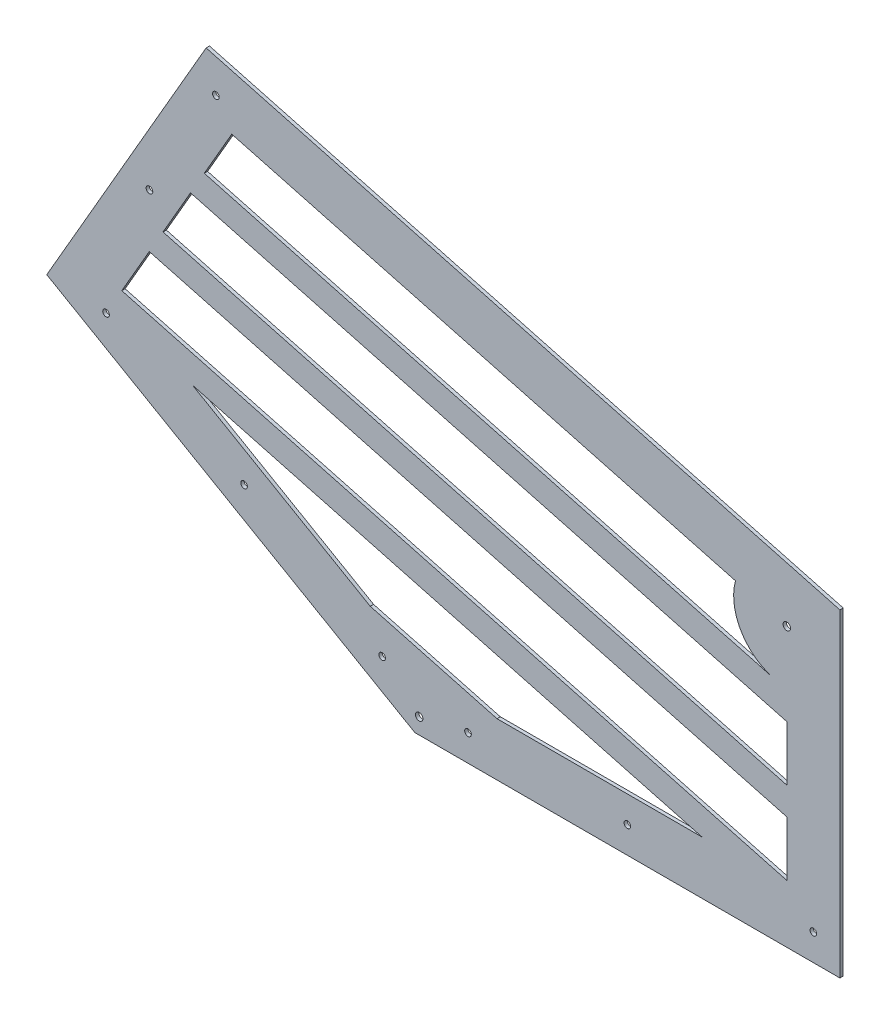
ISO-10303-21;
HEADER;
FILE_DESCRIPTION(('STEP AP214'),'2;1');
FILE_NAME('part.step','',(''),(''),'','','');
FILE_SCHEMA(('AUTOMOTIVE_DESIGN { 1 0 10303 214 1 1 1 1 }'));
ENDSEC;
DATA;
#1=APPLICATION_CONTEXT('core data for automotive mechanical design processes');
#2=APPLICATION_PROTOCOL_DEFINITION('international standard','automotive_design',2000,#1);
#3=PRODUCT_CONTEXT('',#1,'mechanical');
#4=PRODUCT('Part','Part','',(#3));
#5=PRODUCT_RELATED_PRODUCT_CATEGORY('part','',(#4));
#6=PRODUCT_DEFINITION_FORMATION('','',#4);
#7=PRODUCT_DEFINITION_CONTEXT('part definition',#1,'design');
#8=PRODUCT_DEFINITION('design','',#6,#7);
#9=PRODUCT_DEFINITION_SHAPE('','',#8);
#10=(LENGTH_UNIT() NAMED_UNIT(*) SI_UNIT(.MILLI.,.METRE.));
#11=(NAMED_UNIT(*) PLANE_ANGLE_UNIT() SI_UNIT($,.RADIAN.));
#12=(NAMED_UNIT(*) SI_UNIT($,.STERADIAN.) SOLID_ANGLE_UNIT());
#13=UNCERTAINTY_MEASURE_WITH_UNIT(LENGTH_MEASURE(1.E-05),#10,'distance_accuracy_value','');
#14=(GEOMETRIC_REPRESENTATION_CONTEXT(3) GLOBAL_UNCERTAINTY_ASSIGNED_CONTEXT((#13)) GLOBAL_UNIT_ASSIGNED_CONTEXT((#10,
#11,#12)) REPRESENTATION_CONTEXT('',''));
#15=CARTESIAN_POINT('',(0.,0.,0.));
#16=DIRECTION('',(0.,0.,1.));
#17=DIRECTION('',(1.,0.,0.));
#18=AXIS2_PLACEMENT_3D('',#15,#16,#17);
#19=CARTESIAN_POINT('',(0.,0.,1.5875));
#20=DIRECTION('',(0.,0.,-1.));
#21=DIRECTION('',(-1.,0.,0.));
#22=AXIS2_PLACEMENT_3D('',#19,#20,#21);
#23=PLANE('',#22);
#24=DIRECTION('',(-0.499999999999992,-0.866025403784443,0.));
#25=VECTOR('',#24,1.);
#26=CARTESIAN_POINT('',(-126.968392013831,135.684294076723,1.5875));
#27=LINE('',#26,#25);
#28=CARTESIAN_POINT('',(-126.968392013831,135.684294076723,1.5875));
#29=VERTEX_POINT('',#28);
#30=CARTESIAN_POINT('',(-140.116399505039,112.911277083654,1.5875));
#31=VERTEX_POINT('',#30);
#32=EDGE_CURVE('E231',#29,#31,#27,.T.);
#33=ORIENTED_EDGE('',*,*,#32,.F.);
#34=DIRECTION('',(-0.965925826289069,0.258819045102516,0.));
#35=VECTOR('',#34,1.);
#36=CARTESIAN_POINT('',(-126.968392013831,135.684294076723,1.5875));
#37=LINE('',#36,#35);
#38=CARTESIAN_POINT('',(177.8,54.0218495580862,1.5875));
#39=VERTEX_POINT('',#38);
#40=EDGE_CURVE('E242',#39,#29,#37,.T.);
#41=ORIENTED_EDGE('',*,*,#40,.F.);
#42=DIRECTION('',(0.,1.,0.));
#43=VECTOR('',#42,1.);
#44=CARTESIAN_POINT('',(177.8,27.72583457567,1.5875));
#45=LINE('',#44,#43);
#46=CARTESIAN_POINT('',(177.8,27.72583457567,1.5875));
#47=VERTEX_POINT('',#46);
#48=EDGE_CURVE('E238',#47,#39,#45,.T.);
#49=ORIENTED_EDGE('',*,*,#48,.F.);
#50=DIRECTION('',(0.965925826289069,-0.258819045102517,0.));
#51=VECTOR('',#50,1.);
#52=CARTESIAN_POINT('',(177.8,27.72583457567,1.5875));
#53=LINE('',#52,#51);
#54=EDGE_CURVE('E234',#31,#47,#53,.T.);
#55=ORIENTED_EDGE('',*,*,#54,.F.);
#56=EDGE_LOOP('',(#33,#41,#49,#55));
#57=FACE_BOUND('',#56,.T.);
#58=DIRECTION('',(-0.965925826289069,0.258819045102517,0.));
#59=VECTOR('',#58,1.);
#60=CARTESIAN_POINT('',(153.265484012258,139.483898250938,1.5875));
#61=LINE('',#60,#59);
#62=CARTESIAN_POINT('',(153.265484012258,139.483898250938,1.5875));
#63=VERTEX_POINT('',#62);
#64=CARTESIAN_POINT('',(-87.5243695402076,204.003345055929,1.5875));
#65=VERTEX_POINT('',#64);
#66=EDGE_CURVE('E317',#63,#65,#61,.T.);
#67=ORIENTED_EDGE('',*,*,#66,.F.);
#68=CARTESIAN_POINT('',(177.8,132.909894505334,1.5875));
#69=DIRECTION('',(0.,0.,-1.));
#70=DIRECTION('',(1.,0.,0.));
#71=AXIS2_PLACEMENT_3D('',#68,#69,#70);
#72=CIRCLE('',#71,25.4);
#73=CARTESIAN_POINT('',(171.225996254396,108.375378517592,1.5875));
#74=VERTEX_POINT('',#73);
#75=EDGE_CURVE('E328',#74,#63,#72,.T.);
#76=ORIENTED_EDGE('',*,*,#75,.F.);
#77=DIRECTION('',(0.965925826289069,-0.258819045102517,0.));
#78=VECTOR('',#77,1.);
#79=CARTESIAN_POINT('',(-100.672377031416,181.23032806286,1.5875));
#80=LINE('',#79,#78);
#81=CARTESIAN_POINT('',(-100.672377031416,181.23032806286,1.5875));
#82=VERTEX_POINT('',#81);
#83=EDGE_CURVE('E324',#82,#74,#80,.T.);
#84=ORIENTED_EDGE('',*,*,#83,.F.);
#85=DIRECTION('',(-0.499999999999995,-0.866025403784442,0.));
#86=VECTOR('',#85,1.);
#87=CARTESIAN_POINT('',(-87.5243695402076,204.003345055929,1.5875));
#88=LINE('',#87,#86);
#89=EDGE_CURVE('E320',#65,#82,#88,.T.);
#90=ORIENTED_EDGE('',*,*,#89,.F.);
#91=EDGE_LOOP('',(#67,#76,#84,#90));
#92=FACE_BOUND('',#91,.T.);
#93=DIRECTION('',(0.866025403784443,-0.499999999999993,0.));
#94=VECTOR('',#93,1.);
#95=CARTESIAN_POINT('',(0.,0.,1.5875));
#96=LINE('',#95,#94);
#97=CARTESIAN_POINT('',(-175.976362048999,101.599999999999,1.5875));
#98=VERTEX_POINT('',#97);
#99=CARTESIAN_POINT('',(0.,0.,1.5875));
#100=VERTEX_POINT('',#99);
#101=EDGE_CURVE('E440',#98,#100,#96,.T.);
#102=ORIENTED_EDGE('',*,*,#101,.T.);
#103=DIRECTION('',(1.,0.,0.));
#104=VECTOR('',#103,1.);
#105=CARTESIAN_POINT('',(0.,0.,1.5875));
#106=LINE('',#105,#104);
#107=CARTESIAN_POINT('',(203.2,0.,1.5875));
#108=VERTEX_POINT('',#107);
#109=EDGE_CURVE('E444',#100,#108,#106,.T.);
#110=ORIENTED_EDGE('',*,*,#109,.T.);
#111=DIRECTION('',(0.,1.,0.));
#112=VECTOR('',#111,1.);
#113=CARTESIAN_POINT('',(203.2,0.,1.5875));
#114=LINE('',#113,#112);
#115=CARTESIAN_POINT('',(203.2,152.4,1.5875));
#116=VERTEX_POINT('',#115);
#117=EDGE_CURVE('E448',#108,#116,#114,.T.);
#118=ORIENTED_EDGE('',*,*,#117,.T.);
#119=DIRECTION('',(-0.965925826289069,0.258819045102517,0.));
#120=VECTOR('',#119,1.);
#121=CARTESIAN_POINT('',(203.2,152.4,1.5875));
#122=LINE('',#121,#120);
#123=CARTESIAN_POINT('',(-99.7763620489998,233.582271536748,1.5875));
#124=VERTEX_POINT('',#123);
#125=EDGE_CURVE('E451',#116,#124,#122,.T.);
#126=ORIENTED_EDGE('',*,*,#125,.T.);
#127=DIRECTION('',(-0.499999999999993,-0.866025403784443,0.));
#128=VECTOR('',#127,1.);
#129=CARTESIAN_POINT('',(-175.976362048999,101.599999999999,1.5875));
#130=LINE('',#129,#128);
#131=EDGE_CURVE('E454',#124,#98,#130,.T.);
#132=ORIENTED_EDGE('',*,*,#131,.T.);
#133=EDGE_LOOP('',(#102,#110,#118,#126,#132));
#134=FACE_BOUND('',#133,.T.);
#135=CARTESIAN_POINT('',(2.04177284632512,7.62,1.5875));
#136=DIRECTION('',(0.,0.,1.));
#137=DIRECTION('',(1.,0.,0.));
#138=AXIS2_PLACEMENT_3D('',#135,#136,#137);
#139=CIRCLE('',#138,1.7859375);
#140=CARTESIAN_POINT('',(3.82771034632513,7.62,1.5875));
#141=VERTEX_POINT('',#140);
#142=EDGE_CURVE('E432',#141,#141,#139,.T.);
#143=ORIENTED_EDGE('',*,*,#142,.F.);
#144=EDGE_LOOP('',(#143));
#145=FACE_BOUND('',#144,.T.);
#146=CARTESIAN_POINT('',(177.8,132.909894505334,1.5875));
#147=DIRECTION('',(0.,0.,1.));
#148=DIRECTION('',(1.,0.,0.));
#149=AXIS2_PLACEMENT_3D('',#146,#147,#148);
#150=CIRCLE('',#149,1.78593749999999);
#151=CARTESIAN_POINT('',(179.5859375,132.909894505334,1.5875));
#152=VERTEX_POINT('',#151);
#153=EDGE_CURVE('E424',#152,#152,#150,.T.);
#154=ORIENTED_EDGE('',*,*,#153,.F.);
#155=EDGE_LOOP('',(#154));
#156=FACE_BOUND('',#155,.T.);
#157=CARTESIAN_POINT('',(190.5,12.7,1.5875));
#158=DIRECTION('',(0.,0.,1.));
#159=DIRECTION('',(1.,0.,0.));
#160=AXIS2_PLACEMENT_3D('',#157,#158,#159);
#161=CIRCLE('',#160,1.58749999999999);
#162=CARTESIAN_POINT('',(192.0875,12.7,1.5875));
#163=VERTEX_POINT('',#162);
#164=EDGE_CURVE('E416',#163,#163,#161,.T.);
#165=ORIENTED_EDGE('',*,*,#164,.F.);
#166=EDGE_LOOP('',(#165));
#167=FACE_BOUND('',#166,.T.);
#168=CARTESIAN_POINT('',(101.6,12.7,1.5875));
#169=DIRECTION('',(0.,0.,1.));
#170=DIRECTION('',(1.,0.,0.));
#171=AXIS2_PLACEMENT_3D('',#168,#169,#170);
#172=CIRCLE('',#171,1.5875);
#173=CARTESIAN_POINT('',(103.1875,12.7,1.5875));
#174=VERTEX_POINT('',#173);
#175=EDGE_CURVE('E408',#174,#174,#172,.T.);
#176=ORIENTED_EDGE('',*,*,#175,.F.);
#177=EDGE_LOOP('',(#176));
#178=FACE_BOUND('',#177,.T.);
#179=CARTESIAN_POINT('',(25.4,12.7,1.5875));
#180=DIRECTION('',(0.,0.,1.));
#181=DIRECTION('',(1.,0.,0.));
#182=AXIS2_PLACEMENT_3D('',#179,#180,#181);
#183=CIRCLE('',#182,1.5875);
#184=CARTESIAN_POINT('',(26.9875,12.7,1.5875));
#185=VERTEX_POINT('',#184);
#186=EDGE_CURVE('E400',#185,#185,#183,.T.);
#187=ORIENTED_EDGE('',*,*,#186,.F.);
#188=EDGE_LOOP('',(#187));
#189=FACE_BOUND('',#188,.T.);
#190=CARTESIAN_POINT('',(-147.629316792874,99.8985226280612,1.5875));
#191=DIRECTION('',(0.,0.,1.));
#192=DIRECTION('',(1.,0.,0.));
#193=AXIS2_PLACEMENT_3D('',#190,#191,#192);
#194=CIRCLE('',#193,1.5875000000001);
#195=CARTESIAN_POINT('',(-146.041816792874,99.8985226280612,1.5875));
#196=VERTEX_POINT('',#195);
#197=EDGE_CURVE('E392',#196,#196,#194,.T.);
#198=ORIENTED_EDGE('',*,*,#197,.F.);
#199=EDGE_LOOP('',(#198));
#200=FACE_BOUND('',#199,.T.);
#201=CARTESIAN_POINT('',(-81.6381810244994,61.7985226280617,1.5875));
#202=DIRECTION('',(0.,0.,1.));
#203=DIRECTION('',(1.,0.,0.));
#204=AXIS2_PLACEMENT_3D('',#201,#202,#203);
#205=CIRCLE('',#204,1.58750000000006);
#206=CARTESIAN_POINT('',(-80.0506810244994,61.7985226280617,1.5875));
#207=VERTEX_POINT('',#206);
#208=EDGE_CURVE('E384',#207,#207,#205,.T.);
#209=ORIENTED_EDGE('',*,*,#208,.F.);
#210=EDGE_LOOP('',(#209));
#211=FACE_BOUND('',#210,.T.);
#212=CARTESIAN_POINT('',(-15.6470452561249,23.6985226280622,1.5875));
#213=DIRECTION('',(0.,0.,1.));
#214=DIRECTION('',(1.,0.,0.));
#215=AXIS2_PLACEMENT_3D('',#212,#213,#214);
#216=CIRCLE('',#215,1.58749999999999);
#217=CARTESIAN_POINT('',(-14.0595452561249,23.6985226280622,1.5875));
#218=VERTEX_POINT('',#217);
#219=EDGE_CURVE('E376',#218,#218,#216,.T.);
#220=ORIENTED_EDGE('',*,*,#219,.F.);
#221=EDGE_LOOP('',(#220));
#222=FACE_BOUND('',#221,.T.);
#223=CARTESIAN_POINT('',(-95.1278394209373,216.233748908685,1.5875));
#224=DIRECTION('',(0.,0.,1.));
#225=DIRECTION('',(1.,0.,0.));
#226=AXIS2_PLACEMENT_3D('',#223,#224,#225);
#227=CIRCLE('',#226,1.58749999999961);
#228=CARTESIAN_POINT('',(-93.5403394209377,216.233748908685,1.5875));
#229=VERTEX_POINT('',#228);
#230=EDGE_CURVE('E368',#229,#229,#227,.T.);
#231=ORIENTED_EDGE('',*,*,#230,.F.);
#232=EDGE_LOOP('',(#231));
#233=FACE_BOUND('',#232,.T.);
#234=CARTESIAN_POINT('',(-126.877839420937,161.241135768373,1.5875));
#235=DIRECTION('',(0.,0.,1.));
#236=DIRECTION('',(1.,0.,0.));
#237=AXIS2_PLACEMENT_3D('',#234,#235,#236);
#238=CIRCLE('',#237,1.58749999999991);
#239=CARTESIAN_POINT('',(-125.290339420937,161.241135768373,1.5875));
#240=VERTEX_POINT('',#239);
#241=EDGE_CURVE('E360',#240,#240,#238,.T.);
#242=ORIENTED_EDGE('',*,*,#241,.F.);
#243=EDGE_LOOP('',(#242));
#244=FACE_BOUND('',#243,.T.);
#245=DIRECTION('',(-0.499999999999993,-0.866025403784442,0.));
#246=VECTOR('',#245,1.);
#247=CARTESIAN_POINT('',(-107.246380777019,169.843819566326,1.5875));
#248=LINE('',#247,#246);
#249=CARTESIAN_POINT('',(-107.246380777019,169.843819566326,1.5875));
#250=VERTEX_POINT('',#249);
#251=CARTESIAN_POINT('',(-120.394388268227,147.070802573257,1.5875));
#252=VERTEX_POINT('',#251);
#253=EDGE_CURVE('E274',#250,#252,#248,.T.);
#254=ORIENTED_EDGE('',*,*,#253,.F.);
#255=DIRECTION('',(-0.965925826289069,0.258819045102517,0.));
#256=VECTOR('',#255,1.);
#257=CARTESIAN_POINT('',(-107.246380777019,169.843819566326,1.5875));
#258=LINE('',#257,#256);
#259=CARTESIAN_POINT('',(177.8,93.4658720317103,1.5875));
#260=VERTEX_POINT('',#259);
#261=EDGE_CURVE('E285',#260,#250,#258,.T.);
#262=ORIENTED_EDGE('',*,*,#261,.F.);
#263=DIRECTION('',(0.,1.,0.));
#264=VECTOR('',#263,1.);
#265=CARTESIAN_POINT('',(177.8,67.1698570492941,1.5875));
#266=LINE('',#265,#264);
#267=CARTESIAN_POINT('',(177.8,67.1698570492941,1.5875));
#268=VERTEX_POINT('',#267);
#269=EDGE_CURVE('E281',#268,#260,#266,.T.);
#270=ORIENTED_EDGE('',*,*,#269,.F.);
#271=DIRECTION('',(0.965925826289069,-0.258819045102517,0.));
#272=VECTOR('',#271,1.);
#273=CARTESIAN_POINT('',(177.8,67.1698570492941,1.5875));
#274=LINE('',#273,#272);
#275=EDGE_CURVE('E277',#252,#268,#274,.T.);
#276=ORIENTED_EDGE('',*,*,#275,.F.);
#277=EDGE_LOOP('',(#254,#262,#270,#276));
#278=FACE_BOUND('',#277,.T.);
#279=DIRECTION('',(-0.965925826289069,0.258819045102517,0.));
#280=VECTOR('',#279,1.);
#281=CARTESIAN_POINT('',(-106.301504081559,90.7025956715818,1.5875));
#282=LINE('',#281,#280);
#283=CARTESIAN_POINT('',(137.411100830916,25.4,1.5875));
#284=VERTEX_POINT('',#283);
#285=CARTESIAN_POINT('',(-106.301504081559,90.7025956715818,1.5875));
#286=VERTEX_POINT('',#285);
#287=EDGE_CURVE('E183',#284,#286,#282,.T.);
#288=ORIENTED_EDGE('',*,*,#287,.F.);
#289=DIRECTION('',(1.,0.,0.));
#290=VECTOR('',#289,1.);
#291=CARTESIAN_POINT('',(39.273036879945,25.4,1.5875));
#292=LINE('',#291,#290);
#293=CARTESIAN_POINT('',(39.273036879945,25.4,1.5875));
#294=VERTEX_POINT('',#293);
#295=EDGE_CURVE('E209',#294,#284,#292,.T.);
#296=ORIENTED_EDGE('',*,*,#295,.F.);
#297=DIRECTION('',(0.965925826289069,-0.258819045102518,0.));
#298=VECTOR('',#297,1.);
#299=CARTESIAN_POINT('',(39.273036879945,25.4,1.5875));
#300=LINE('',#299,#298);
#301=CARTESIAN_POINT('',(-21.311447621796,41.6335636960972,1.5875));
#302=VERTEX_POINT('',#301);
#303=EDGE_CURVE('E205',#302,#294,#300,.T.);
#304=ORIENTED_EDGE('',*,*,#303,.F.);
#305=DIRECTION('',(0.866025403784443,-0.499999999999993,0.));
#306=VECTOR('',#305,1.);
#307=CARTESIAN_POINT('',(-106.301504081559,90.7025956715818,1.5875));
#308=LINE('',#307,#306);
#309=EDGE_CURVE('E192',#286,#302,#308,.T.);
#310=ORIENTED_EDGE('',*,*,#309,.F.);
#311=EDGE_LOOP('',(#288,#296,#304,#310));
#312=FACE_BOUND('',#311,.T.);
#313=ADVANCED_FACE('F39',(#57,#92,#134,#145,#156,#167,#178,#189,#200,#211,#222,#233,#244,#278,
#312),#23,.F.);
#314=CARTESIAN_POINT('',(0.,0.,0.));
#315=DIRECTION('',(0.,0.,-1.));
#316=DIRECTION('',(-1.,0.,0.));
#317=AXIS2_PLACEMENT_3D('',#314,#315,#316);
#318=PLANE('',#317);
#319=CARTESIAN_POINT('',(-95.1278394209373,216.233748908685,0.));
#320=DIRECTION('',(0.,0.,1.));
#321=DIRECTION('',(1.,0.,0.));
#322=AXIS2_PLACEMENT_3D('',#319,#320,#321);
#323=CIRCLE('',#322,1.58749999999961);
#324=CARTESIAN_POINT('',(-93.5403394209377,216.233748908685,0.));
#325=VERTEX_POINT('',#324);
#326=EDGE_CURVE('E364',#325,#325,#323,.T.);
#327=ORIENTED_EDGE('',*,*,#326,.T.);
#328=EDGE_LOOP('',(#327));
#329=FACE_BOUND('',#328,.T.);
#330=CARTESIAN_POINT('',(-81.6381810244994,61.7985226280617,0.));
#331=DIRECTION('',(0.,0.,1.));
#332=DIRECTION('',(1.,0.,0.));
#333=AXIS2_PLACEMENT_3D('',#330,#331,#332);
#334=CIRCLE('',#333,1.58750000000006);
#335=CARTESIAN_POINT('',(-80.0506810244994,61.7985226280617,0.));
#336=VERTEX_POINT('',#335);
#337=EDGE_CURVE('E380',#336,#336,#334,.T.);
#338=ORIENTED_EDGE('',*,*,#337,.T.);
#339=EDGE_LOOP('',(#338));
#340=FACE_BOUND('',#339,.T.);
#341=CARTESIAN_POINT('',(25.4,12.7,0.));
#342=DIRECTION('',(0.,0.,1.));
#343=DIRECTION('',(1.,0.,0.));
#344=AXIS2_PLACEMENT_3D('',#341,#342,#343);
#345=CIRCLE('',#344,1.5875);
#346=CARTESIAN_POINT('',(26.9875,12.7,0.));
#347=VERTEX_POINT('',#346);
#348=EDGE_CURVE('E396',#347,#347,#345,.T.);
#349=ORIENTED_EDGE('',*,*,#348,.T.);
#350=EDGE_LOOP('',(#349));
#351=FACE_BOUND('',#350,.T.);
#352=CARTESIAN_POINT('',(190.5,12.7,0.));
#353=DIRECTION('',(0.,0.,1.));
#354=DIRECTION('',(1.,0.,0.));
#355=AXIS2_PLACEMENT_3D('',#352,#353,#354);
#356=CIRCLE('',#355,1.58749999999999);
#357=CARTESIAN_POINT('',(192.0875,12.7,0.));
#358=VERTEX_POINT('',#357);
#359=EDGE_CURVE('E412',#358,#358,#356,.T.);
#360=ORIENTED_EDGE('',*,*,#359,.T.);
#361=EDGE_LOOP('',(#360));
#362=FACE_BOUND('',#361,.T.);
#363=CARTESIAN_POINT('',(2.04177284632512,7.62,0.));
#364=DIRECTION('',(0.,0.,1.));
#365=DIRECTION('',(1.,0.,0.));
#366=AXIS2_PLACEMENT_3D('',#363,#364,#365);
#367=CIRCLE('',#366,1.7859375);
#368=CARTESIAN_POINT('',(3.82771034632513,7.62,0.));
#369=VERTEX_POINT('',#368);
#370=EDGE_CURVE('E428',#369,#369,#367,.T.);
#371=ORIENTED_EDGE('',*,*,#370,.T.);
#372=EDGE_LOOP('',(#371));
#373=FACE_BOUND('',#372,.T.);
#374=DIRECTION('',(0.866025403784443,-0.499999999999993,0.));
#375=VECTOR('',#374,1.);
#376=CARTESIAN_POINT('',(0.,0.,0.));
#377=LINE('',#376,#375);
#378=CARTESIAN_POINT('',(-175.976362048999,101.599999999999,0.));
#379=VERTEX_POINT('',#378);
#380=CARTESIAN_POINT('',(0.,0.,0.));
#381=VERTEX_POINT('',#380);
#382=EDGE_CURVE('E436',#379,#381,#377,.T.);
#383=ORIENTED_EDGE('',*,*,#382,.F.);
#384=DIRECTION('',(-0.499999999999993,-0.866025403784443,0.));
#385=VECTOR('',#384,1.);
#386=CARTESIAN_POINT('',(-175.976362048999,101.599999999999,0.));
#387=LINE('',#386,#385);
#388=CARTESIAN_POINT('',(-99.7763620489998,233.582271536748,0.));
#389=VERTEX_POINT('',#388);
#390=EDGE_CURVE('E445',#389,#379,#387,.T.);
#391=ORIENTED_EDGE('',*,*,#390,.F.);
#392=DIRECTION('',(-0.965925826289069,0.258819045102517,0.));
#393=VECTOR('',#392,1.);
#394=CARTESIAN_POINT('',(203.2,152.4,0.));
#395=LINE('',#394,#393);
#396=CARTESIAN_POINT('',(203.2,152.4,0.));
#397=VERTEX_POINT('',#396);
#398=EDGE_CURVE('E467',#397,#389,#395,.T.);
#399=ORIENTED_EDGE('',*,*,#398,.F.);
#400=DIRECTION('',(0.,1.,0.));
#401=VECTOR('',#400,1.);
#402=CARTESIAN_POINT('',(203.2,0.,0.));
#403=LINE('',#402,#401);
#404=CARTESIAN_POINT('',(203.2,0.,0.));
#405=VERTEX_POINT('',#404);
#406=EDGE_CURVE('E464',#405,#397,#403,.T.);
#407=ORIENTED_EDGE('',*,*,#406,.F.);
#408=DIRECTION('',(1.,0.,0.));
#409=VECTOR('',#408,1.);
#410=CARTESIAN_POINT('',(0.,0.,0.));
#411=LINE('',#410,#409);
#412=EDGE_CURVE('E461',#381,#405,#411,.T.);
#413=ORIENTED_EDGE('',*,*,#412,.F.);
#414=EDGE_LOOP('',(#383,#391,#399,#407,#413));
#415=FACE_BOUND('',#414,.T.);
#416=CARTESIAN_POINT('',(177.8,132.909894505334,0.));
#417=DIRECTION('',(0.,0.,1.));
#418=DIRECTION('',(1.,0.,0.));
#419=AXIS2_PLACEMENT_3D('',#416,#417,#418);
#420=CIRCLE('',#419,1.78593749999999);
#421=CARTESIAN_POINT('',(179.5859375,132.909894505334,0.));
#422=VERTEX_POINT('',#421);
#423=EDGE_CURVE('E420',#422,#422,#420,.T.);
#424=ORIENTED_EDGE('',*,*,#423,.T.);
#425=EDGE_LOOP('',(#424));
#426=FACE_BOUND('',#425,.T.);
#427=CARTESIAN_POINT('',(101.6,12.7,0.));
#428=DIRECTION('',(0.,0.,1.));
#429=DIRECTION('',(1.,0.,0.));
#430=AXIS2_PLACEMENT_3D('',#427,#428,#429);
#431=CIRCLE('',#430,1.5875);
#432=CARTESIAN_POINT('',(103.1875,12.7,0.));
#433=VERTEX_POINT('',#432);
#434=EDGE_CURVE('E404',#433,#433,#431,.T.);
#435=ORIENTED_EDGE('',*,*,#434,.T.);
#436=EDGE_LOOP('',(#435));
#437=FACE_BOUND('',#436,.T.);
#438=CARTESIAN_POINT('',(-147.629316792874,99.8985226280612,0.));
#439=DIRECTION('',(0.,0.,1.));
#440=DIRECTION('',(1.,0.,0.));
#441=AXIS2_PLACEMENT_3D('',#438,#439,#440);
#442=CIRCLE('',#441,1.5875000000001);
#443=CARTESIAN_POINT('',(-146.041816792874,99.8985226280612,0.));
#444=VERTEX_POINT('',#443);
#445=EDGE_CURVE('E388',#444,#444,#442,.T.);
#446=ORIENTED_EDGE('',*,*,#445,.T.);
#447=EDGE_LOOP('',(#446));
#448=FACE_BOUND('',#447,.T.);
#449=CARTESIAN_POINT('',(-15.6470452561249,23.6985226280622,0.));
#450=DIRECTION('',(0.,0.,1.));
#451=DIRECTION('',(1.,0.,0.));
#452=AXIS2_PLACEMENT_3D('',#449,#450,#451);
#453=CIRCLE('',#452,1.58749999999999);
#454=CARTESIAN_POINT('',(-14.0595452561249,23.6985226280622,0.));
#455=VERTEX_POINT('',#454);
#456=EDGE_CURVE('E372',#455,#455,#453,.T.);
#457=ORIENTED_EDGE('',*,*,#456,.T.);
#458=EDGE_LOOP('',(#457));
#459=FACE_BOUND('',#458,.T.);
#460=CARTESIAN_POINT('',(-126.877839420937,161.241135768373,0.));
#461=DIRECTION('',(0.,0.,1.));
#462=DIRECTION('',(1.,0.,0.));
#463=AXIS2_PLACEMENT_3D('',#460,#461,#462);
#464=CIRCLE('',#463,1.58749999999991);
#465=CARTESIAN_POINT('',(-125.290339420937,161.241135768373,0.));
#466=VERTEX_POINT('',#465);
#467=EDGE_CURVE('E359',#466,#466,#464,.T.);
#468=ORIENTED_EDGE('',*,*,#467,.T.);
#469=EDGE_LOOP('',(#468));
#470=FACE_BOUND('',#469,.T.);
#471=CARTESIAN_POINT('',(177.8,132.909894505334,0.));
#472=DIRECTION('',(0.,0.,-1.));
#473=DIRECTION('',(1.,0.,0.));
#474=AXIS2_PLACEMENT_3D('',#471,#472,#473);
#475=CIRCLE('',#474,25.4);
#476=CARTESIAN_POINT('',(171.225996254396,108.375378517592,0.));
#477=VERTEX_POINT('',#476);
#478=CARTESIAN_POINT('',(153.265484012258,139.483898250938,0.));
#479=VERTEX_POINT('',#478);
#480=EDGE_CURVE('E321',#477,#479,#475,.T.);
#481=ORIENTED_EDGE('',*,*,#480,.T.);
#482=DIRECTION('',(-0.965925826289069,0.258819045102517,0.));
#483=VECTOR('',#482,1.);
#484=CARTESIAN_POINT('',(153.265484012258,139.483898250938,0.));
#485=LINE('',#484,#483);
#486=CARTESIAN_POINT('',(-87.5243695402076,204.003345055929,0.));
#487=VERTEX_POINT('',#486);
#488=EDGE_CURVE('E316',#479,#487,#485,.T.);
#489=ORIENTED_EDGE('',*,*,#488,.T.);
#490=DIRECTION('',(-0.499999999999995,-0.866025403784442,0.));
#491=VECTOR('',#490,1.);
#492=CARTESIAN_POINT('',(-87.5243695402076,204.003345055929,0.));
#493=LINE('',#492,#491);
#494=CARTESIAN_POINT('',(-100.672377031416,181.23032806286,0.));
#495=VERTEX_POINT('',#494);
#496=EDGE_CURVE('E335',#487,#495,#493,.T.);
#497=ORIENTED_EDGE('',*,*,#496,.T.);
#498=DIRECTION('',(0.965925826289069,-0.258819045102517,0.));
#499=VECTOR('',#498,1.);
#500=CARTESIAN_POINT('',(-100.672377031416,181.23032806286,0.));
#501=LINE('',#500,#499);
#502=EDGE_CURVE('E339',#495,#477,#501,.T.);
#503=ORIENTED_EDGE('',*,*,#502,.T.);
#504=EDGE_LOOP('',(#481,#489,#497,#503));
#505=FACE_BOUND('',#504,.T.);
#506=DIRECTION('',(-0.965925826289069,0.258819045102517,0.));
#507=VECTOR('',#506,1.);
#508=CARTESIAN_POINT('',(-107.246380777019,169.843819566326,0.));
#509=LINE('',#508,#507);
#510=CARTESIAN_POINT('',(177.8,93.4658720317103,0.));
#511=VERTEX_POINT('',#510);
#512=CARTESIAN_POINT('',(-107.246380777019,169.843819566326,0.));
#513=VERTEX_POINT('',#512);
#514=EDGE_CURVE('E278',#511,#513,#509,.T.);
#515=ORIENTED_EDGE('',*,*,#514,.T.);
#516=DIRECTION('',(-0.499999999999993,-0.866025403784442,0.));
#517=VECTOR('',#516,1.);
#518=CARTESIAN_POINT('',(-107.246380777019,169.843819566326,0.));
#519=LINE('',#518,#517);
#520=CARTESIAN_POINT('',(-120.394388268227,147.070802573257,0.));
#521=VERTEX_POINT('',#520);
#522=EDGE_CURVE('E273',#513,#521,#519,.T.);
#523=ORIENTED_EDGE('',*,*,#522,.T.);
#524=DIRECTION('',(0.965925826289069,-0.258819045102517,0.));
#525=VECTOR('',#524,1.);
#526=CARTESIAN_POINT('',(177.8,67.1698570492941,0.));
#527=LINE('',#526,#525);
#528=CARTESIAN_POINT('',(177.8,67.1698570492941,0.));
#529=VERTEX_POINT('',#528);
#530=EDGE_CURVE('E292',#521,#529,#527,.T.);
#531=ORIENTED_EDGE('',*,*,#530,.T.);
#532=DIRECTION('',(0.,1.,0.));
#533=VECTOR('',#532,1.);
#534=CARTESIAN_POINT('',(177.8,67.1698570492941,0.));
#535=LINE('',#534,#533);
#536=EDGE_CURVE('E296',#529,#511,#535,.T.);
#537=ORIENTED_EDGE('',*,*,#536,.T.);
#538=EDGE_LOOP('',(#515,#523,#531,#537));
#539=FACE_BOUND('',#538,.T.);
#540=DIRECTION('',(-0.965925826289069,0.258819045102516,0.));
#541=VECTOR('',#540,1.);
#542=CARTESIAN_POINT('',(-126.968392013831,135.684294076723,0.));
#543=LINE('',#542,#541);
#544=CARTESIAN_POINT('',(177.8,54.0218495580862,0.));
#545=VERTEX_POINT('',#544);
#546=CARTESIAN_POINT('',(-126.968392013831,135.684294076723,0.));
#547=VERTEX_POINT('',#546);
#548=EDGE_CURVE('E235',#545,#547,#543,.T.);
#549=ORIENTED_EDGE('',*,*,#548,.T.);
#550=DIRECTION('',(-0.499999999999992,-0.866025403784443,0.));
#551=VECTOR('',#550,1.);
#552=CARTESIAN_POINT('',(-126.968392013831,135.684294076723,0.));
#553=LINE('',#552,#551);
#554=CARTESIAN_POINT('',(-140.116399505039,112.911277083654,0.));
#555=VERTEX_POINT('',#554);
#556=EDGE_CURVE('E201',#547,#555,#553,.T.);
#557=ORIENTED_EDGE('',*,*,#556,.T.);
#558=DIRECTION('',(0.965925826289069,-0.258819045102517,0.));
#559=VECTOR('',#558,1.);
#560=CARTESIAN_POINT('',(177.8,27.72583457567,0.));
#561=LINE('',#560,#559);
#562=CARTESIAN_POINT('',(177.8,27.72583457567,0.));
#563=VERTEX_POINT('',#562);
#564=EDGE_CURVE('E249',#555,#563,#561,.T.);
#565=ORIENTED_EDGE('',*,*,#564,.T.);
#566=DIRECTION('',(0.,1.,0.));
#567=VECTOR('',#566,1.);
#568=CARTESIAN_POINT('',(177.8,27.72583457567,0.));
#569=LINE('',#568,#567);
#570=EDGE_CURVE('E253',#563,#545,#569,.T.);
#571=ORIENTED_EDGE('',*,*,#570,.T.);
#572=EDGE_LOOP('',(#549,#557,#565,#571));
#573=FACE_BOUND('',#572,.T.);
#574=DIRECTION('',(1.,0.,0.));
#575=VECTOR('',#574,1.);
#576=CARTESIAN_POINT('',(39.273036879945,25.4,0.));
#577=LINE('',#576,#575);
#578=CARTESIAN_POINT('',(39.273036879945,25.4,0.));
#579=VERTEX_POINT('',#578);
#580=CARTESIAN_POINT('',(137.411100830916,25.4,0.));
#581=VERTEX_POINT('',#580);
#582=EDGE_CURVE('E193',#579,#581,#577,.T.);
#583=ORIENTED_EDGE('',*,*,#582,.T.);
#584=DIRECTION('',(-0.965925826289069,0.258819045102517,0.));
#585=VECTOR('',#584,1.);
#586=CARTESIAN_POINT('',(-106.301504081559,90.7025956715818,0.));
#587=LINE('',#586,#585);
#588=CARTESIAN_POINT('',(-106.301504081559,90.7025956715818,0.));
#589=VERTEX_POINT('',#588);
#590=EDGE_CURVE('E63',#581,#589,#587,.T.);
#591=ORIENTED_EDGE('',*,*,#590,.T.);
#592=DIRECTION('',(0.866025403784443,-0.499999999999993,0.));
#593=VECTOR('',#592,1.);
#594=CARTESIAN_POINT('',(-106.301504081559,90.7025956715818,0.));
#595=LINE('',#594,#593);
#596=CARTESIAN_POINT('',(-21.311447621796,41.6335636960972,0.));
#597=VERTEX_POINT('',#596);
#598=EDGE_CURVE('E199',#589,#597,#595,.T.);
#599=ORIENTED_EDGE('',*,*,#598,.T.);
#600=DIRECTION('',(0.965925826289069,-0.258819045102518,0.));
#601=VECTOR('',#600,1.);
#602=CARTESIAN_POINT('',(39.273036879945,25.4,0.));
#603=LINE('',#602,#601);
#604=EDGE_CURVE('E218',#597,#579,#603,.T.);
#605=ORIENTED_EDGE('',*,*,#604,.T.);
#606=EDGE_LOOP('',(#583,#591,#599,#605));
#607=FACE_BOUND('',#606,.T.);
#608=ADVANCED_FACE('F494',(#329,#340,#351,#362,#373,#415,#426,#437,#448,#459,#470,#505,#539,
#573,#607),#318,.T.);
#609=CARTESIAN_POINT('',(0.,0.,1.5875));
#610=DIRECTION('',(0.499999999999993,0.866025403784443,0.));
#611=DIRECTION('',(-0.866025403784443,0.499999999999993,0.));
#612=AXIS2_PLACEMENT_3D('',#609,#610,#611);
#613=PLANE('',#612);
#614=ORIENTED_EDGE('',*,*,#382,.T.);
#615=DIRECTION('',(0.,0.,-1.));
#616=VECTOR('',#615,1.);
#617=CARTESIAN_POINT('',(0.,0.,1.5875));
#618=LINE('',#617,#616);
#619=EDGE_CURVE('E11',#100,#381,#618,.T.);
#620=ORIENTED_EDGE('',*,*,#619,.F.);
#621=ORIENTED_EDGE('',*,*,#101,.F.);
#622=DIRECTION('',(0.,0.,-1.));
#623=VECTOR('',#622,1.);
#624=CARTESIAN_POINT('',(-175.976362048999,101.599999999999,1.5875));
#625=LINE('',#624,#623);
#626=EDGE_CURVE('E457',#98,#379,#625,.T.);
#627=ORIENTED_EDGE('',*,*,#626,.T.);
#628=EDGE_LOOP('',(#614,#620,#621,#627));
#629=FACE_BOUND('',#628,.T.);
#630=ADVANCED_FACE('F41',(#629),#613,.F.);
#631=CARTESIAN_POINT('',(0.,0.,1.5875));
#632=DIRECTION('',(0.,1.,0.));
#633=DIRECTION('',(0.,0.,1.));
#634=AXIS2_PLACEMENT_3D('',#631,#632,#633);
#635=PLANE('',#634);
#636=ORIENTED_EDGE('',*,*,#412,.T.);
#637=DIRECTION('',(0.,0.,-1.));
#638=VECTOR('',#637,1.);
#639=CARTESIAN_POINT('',(203.2,0.,1.5875));
#640=LINE('',#639,#638);
#641=EDGE_CURVE('E48',#108,#405,#640,.T.);
#642=ORIENTED_EDGE('',*,*,#641,.F.);
#643=ORIENTED_EDGE('',*,*,#109,.F.);
#644=ORIENTED_EDGE('',*,*,#619,.T.);
#645=EDGE_LOOP('',(#636,#642,#643,#644));
#646=FACE_BOUND('',#645,.T.);
#647=ADVANCED_FACE('F509',(#646),#635,.F.);
#648=CARTESIAN_POINT('',(203.2,0.,1.5875));
#649=DIRECTION('',(-1.,0.,0.));
#650=DIRECTION('',(0.,0.,1.));
#651=AXIS2_PLACEMENT_3D('',#648,#649,#650);
#652=PLANE('',#651);
#653=ORIENTED_EDGE('',*,*,#406,.T.);
#654=DIRECTION('',(0.,0.,-1.));
#655=VECTOR('',#654,1.);
#656=CARTESIAN_POINT('',(203.2,152.4,1.5875));
#657=LINE('',#656,#655);
#658=EDGE_CURVE('E479',#116,#397,#657,.T.);
#659=ORIENTED_EDGE('',*,*,#658,.F.);
#660=ORIENTED_EDGE('',*,*,#117,.F.);
#661=ORIENTED_EDGE('',*,*,#641,.T.);
#662=EDGE_LOOP('',(#653,#659,#660,#661));
#663=FACE_BOUND('',#662,.T.);
#664=ADVANCED_FACE('F488',(#663),#652,.F.);
#665=CARTESIAN_POINT('',(203.2,152.4,1.5875));
#666=DIRECTION('',(-0.258819045102517,-0.965925826289069,0.));
#667=DIRECTION('',(0.965925826289069,-0.258819045102517,0.));
#668=AXIS2_PLACEMENT_3D('',#665,#666,#667);
#669=PLANE('',#668);
#670=ORIENTED_EDGE('',*,*,#398,.T.);
#671=DIRECTION('',(0.,0.,-1.));
#672=VECTOR('',#671,1.);
#673=CARTESIAN_POINT('',(-99.7763620489998,233.582271536748,1.5875));
#674=LINE('',#673,#672);
#675=EDGE_CURVE('E475',#124,#389,#674,.T.);
#676=ORIENTED_EDGE('',*,*,#675,.F.);
#677=ORIENTED_EDGE('',*,*,#125,.F.);
#678=ORIENTED_EDGE('',*,*,#658,.T.);
#679=EDGE_LOOP('',(#670,#676,#677,#678));
#680=FACE_BOUND('',#679,.T.);
#681=ADVANCED_FACE('F499',(#680),#669,.F.);
#682=CARTESIAN_POINT('',(-175.976362048999,101.599999999999,1.5875));
#683=DIRECTION('',(0.866025403784443,-0.499999999999993,0.));
#684=DIRECTION('',(0.499999999999993,0.866025403784443,0.));
#685=AXIS2_PLACEMENT_3D('',#682,#683,#684);
#686=PLANE('',#685);
#687=ORIENTED_EDGE('',*,*,#390,.T.);
#688=ORIENTED_EDGE('',*,*,#626,.F.);
#689=ORIENTED_EDGE('',*,*,#131,.F.);
#690=ORIENTED_EDGE('',*,*,#675,.T.);
#691=EDGE_LOOP('',(#687,#688,#689,#690));
#692=FACE_BOUND('',#691,.T.);
#693=ADVANCED_FACE('F503',(#692),#686,.F.);
#694=CARTESIAN_POINT('',(2.04177284632512,7.62,1.5875));
#695=DIRECTION('',(0.,0.,-1.));
#696=DIRECTION('',(-1.,0.,0.));
#697=AXIS2_PLACEMENT_3D('',#694,#695,#696);
#698=CYLINDRICAL_SURFACE('',#697,1.7859375);
#699=ORIENTED_EDGE('',*,*,#142,.T.);
#700=EDGE_LOOP('',(#699));
#701=FACE_BOUND('',#700,.T.);
#702=ORIENTED_EDGE('',*,*,#370,.F.);
#703=EDGE_LOOP('',(#702));
#704=FACE_BOUND('',#703,.T.);
#705=ADVANCED_FACE('F526',(#701,#704),#698,.F.);
#706=CARTESIAN_POINT('',(177.8,132.909894505334,1.5875));
#707=DIRECTION('',(0.,0.,-1.));
#708=DIRECTION('',(-1.,0.,0.));
#709=AXIS2_PLACEMENT_3D('',#706,#707,#708);
#710=CYLINDRICAL_SURFACE('',#709,1.78593749999999);
#711=ORIENTED_EDGE('',*,*,#153,.T.);
#712=EDGE_LOOP('',(#711));
#713=FACE_BOUND('',#712,.T.);
#714=ORIENTED_EDGE('',*,*,#423,.F.);
#715=EDGE_LOOP('',(#714));
#716=FACE_BOUND('',#715,.T.);
#717=ADVANCED_FACE('F552',(#713,#716),#710,.F.);
#718=CARTESIAN_POINT('',(190.5,12.7,1.5875));
#719=DIRECTION('',(0.,0.,-1.));
#720=DIRECTION('',(-1.,0.,0.));
#721=AXIS2_PLACEMENT_3D('',#718,#719,#720);
#722=CYLINDRICAL_SURFACE('',#721,1.58749999999999);
#723=ORIENTED_EDGE('',*,*,#164,.T.);
#724=EDGE_LOOP('',(#723));
#725=FACE_BOUND('',#724,.T.);
#726=ORIENTED_EDGE('',*,*,#359,.F.);
#727=EDGE_LOOP('',(#726));
#728=FACE_BOUND('',#727,.T.);
#729=ADVANCED_FACE('F559',(#725,#728),#722,.F.);
#730=CARTESIAN_POINT('',(101.6,12.7,1.5875));
#731=DIRECTION('',(0.,0.,-1.));
#732=DIRECTION('',(-1.,0.,0.));
#733=AXIS2_PLACEMENT_3D('',#730,#731,#732);
#734=CYLINDRICAL_SURFACE('',#733,1.5875);
#735=ORIENTED_EDGE('',*,*,#175,.T.);
#736=EDGE_LOOP('',(#735));
#737=FACE_BOUND('',#736,.T.);
#738=ORIENTED_EDGE('',*,*,#434,.F.);
#739=EDGE_LOOP('',(#738));
#740=FACE_BOUND('',#739,.T.);
#741=ADVANCED_FACE('F566',(#737,#740),#734,.F.);
#742=CARTESIAN_POINT('',(25.4,12.7,1.5875));
#743=DIRECTION('',(0.,0.,-1.));
#744=DIRECTION('',(-1.,0.,0.));
#745=AXIS2_PLACEMENT_3D('',#742,#743,#744);
#746=CYLINDRICAL_SURFACE('',#745,1.5875);
#747=ORIENTED_EDGE('',*,*,#186,.T.);
#748=EDGE_LOOP('',(#747));
#749=FACE_BOUND('',#748,.T.);
#750=ORIENTED_EDGE('',*,*,#348,.F.);
#751=EDGE_LOOP('',(#750));
#752=FACE_BOUND('',#751,.T.);
#753=ADVANCED_FACE('F574',(#749,#752),#746,.F.);
#754=CARTESIAN_POINT('',(-147.629316792874,99.8985226280612,1.5875));
#755=DIRECTION('',(0.,0.,-1.));
#756=DIRECTION('',(-1.,0.,0.));
#757=AXIS2_PLACEMENT_3D('',#754,#755,#756);
#758=CYLINDRICAL_SURFACE('',#757,1.5875000000001);
#759=ORIENTED_EDGE('',*,*,#197,.T.);
#760=EDGE_LOOP('',(#759));
#761=FACE_BOUND('',#760,.T.);
#762=ORIENTED_EDGE('',*,*,#445,.F.);
#763=EDGE_LOOP('',(#762));
#764=FACE_BOUND('',#763,.T.);
#765=ADVANCED_FACE('F582',(#761,#764),#758,.F.);
#766=CARTESIAN_POINT('',(-81.6381810244994,61.7985226280617,1.5875));
#767=DIRECTION('',(0.,0.,-1.));
#768=DIRECTION('',(-1.,0.,0.));
#769=AXIS2_PLACEMENT_3D('',#766,#767,#768);
#770=CYLINDRICAL_SURFACE('',#769,1.58750000000006);
#771=ORIENTED_EDGE('',*,*,#208,.T.);
#772=EDGE_LOOP('',(#771));
#773=FACE_BOUND('',#772,.T.);
#774=ORIENTED_EDGE('',*,*,#337,.F.);
#775=EDGE_LOOP('',(#774));
#776=FACE_BOUND('',#775,.T.);
#777=ADVANCED_FACE('F590',(#773,#776),#770,.F.);
#778=CARTESIAN_POINT('',(-15.6470452561249,23.6985226280622,1.5875));
#779=DIRECTION('',(0.,0.,-1.));
#780=DIRECTION('',(-1.,0.,0.));
#781=AXIS2_PLACEMENT_3D('',#778,#779,#780);
#782=CYLINDRICAL_SURFACE('',#781,1.58749999999999);
#783=ORIENTED_EDGE('',*,*,#219,.T.);
#784=EDGE_LOOP('',(#783));
#785=FACE_BOUND('',#784,.T.);
#786=ORIENTED_EDGE('',*,*,#456,.F.);
#787=EDGE_LOOP('',(#786));
#788=FACE_BOUND('',#787,.T.);
#789=ADVANCED_FACE('F598',(#785,#788),#782,.F.);
#790=CARTESIAN_POINT('',(-95.1278394209373,216.233748908685,1.5875));
#791=DIRECTION('',(0.,0.,-1.));
#792=DIRECTION('',(-1.,0.,0.));
#793=AXIS2_PLACEMENT_3D('',#790,#791,#792);
#794=CYLINDRICAL_SURFACE('',#793,1.58749999999961);
#795=ORIENTED_EDGE('',*,*,#230,.T.);
#796=EDGE_LOOP('',(#795));
#797=FACE_BOUND('',#796,.T.);
#798=ORIENTED_EDGE('',*,*,#326,.F.);
#799=EDGE_LOOP('',(#798));
#800=FACE_BOUND('',#799,.T.);
#801=ADVANCED_FACE('F606',(#797,#800),#794,.F.);
#802=CARTESIAN_POINT('',(-126.877839420937,161.241135768373,1.5875));
#803=DIRECTION('',(0.,0.,-1.));
#804=DIRECTION('',(-1.,0.,0.));
#805=AXIS2_PLACEMENT_3D('',#802,#803,#804);
#806=CYLINDRICAL_SURFACE('',#805,1.58749999999991);
#807=ORIENTED_EDGE('',*,*,#241,.T.);
#808=EDGE_LOOP('',(#807));
#809=FACE_BOUND('',#808,.T.);
#810=ORIENTED_EDGE('',*,*,#467,.F.);
#811=EDGE_LOOP('',(#810));
#812=FACE_BOUND('',#811,.T.);
#813=ADVANCED_FACE('F614',(#809,#812),#806,.F.);
#814=CARTESIAN_POINT('',(153.265484012258,139.483898250938,1.5875));
#815=DIRECTION('',(-0.258819045102517,-0.965925826289069,0.));
#816=DIRECTION('',(0.965925826289069,-0.258819045102517,0.));
#817=AXIS2_PLACEMENT_3D('',#814,#815,#816);
#818=PLANE('',#817);
#819=ORIENTED_EDGE('',*,*,#488,.F.);
#820=DIRECTION('',(0.,0.,-1.));
#821=VECTOR('',#820,1.);
#822=CARTESIAN_POINT('',(153.265484012258,139.483898250938,1.5875));
#823=LINE('',#822,#821);
#824=EDGE_CURVE('E331',#63,#479,#823,.T.);
#825=ORIENTED_EDGE('',*,*,#824,.F.);
#826=ORIENTED_EDGE('',*,*,#66,.T.);
#827=DIRECTION('',(0.,0.,-1.));
#828=VECTOR('',#827,1.);
#829=CARTESIAN_POINT('',(-87.5243695402076,204.003345055929,1.5875));
#830=LINE('',#829,#828);
#831=EDGE_CURVE('E355',#65,#487,#830,.T.);
#832=ORIENTED_EDGE('',*,*,#831,.T.);
#833=EDGE_LOOP('',(#819,#825,#826,#832));
#834=FACE_BOUND('',#833,.T.);
#835=ADVANCED_FACE('F622',(#834),#818,.T.);
#836=CARTESIAN_POINT('',(-87.5243695402076,204.003345055929,1.5875));
#837=DIRECTION('',(0.866025403784442,-0.499999999999995,0.));
#838=DIRECTION('',(0.499999999999995,0.866025403784442,0.));
#839=AXIS2_PLACEMENT_3D('',#836,#837,#838);
#840=PLANE('',#839);
#841=ORIENTED_EDGE('',*,*,#496,.F.);
#842=ORIENTED_EDGE('',*,*,#831,.F.);
#843=ORIENTED_EDGE('',*,*,#89,.T.);
#844=DIRECTION('',(0.,0.,-1.));
#845=VECTOR('',#844,1.);
#846=CARTESIAN_POINT('',(-100.672377031416,181.23032806286,1.5875));
#847=LINE('',#846,#845);
#848=EDGE_CURVE('E352',#82,#495,#847,.T.);
#849=ORIENTED_EDGE('',*,*,#848,.T.);
#850=EDGE_LOOP('',(#841,#842,#843,#849));
#851=FACE_BOUND('',#850,.T.);
#852=ADVANCED_FACE('F630',(#851),#840,.T.);
#853=CARTESIAN_POINT('',(-100.672377031416,181.23032806286,1.5875));
#854=DIRECTION('',(0.258819045102517,0.965925826289069,0.));
#855=DIRECTION('',(-0.96592582628907,0.258819045102517,0.));
#856=AXIS2_PLACEMENT_3D('',#853,#854,#855);
#857=PLANE('',#856);
#858=ORIENTED_EDGE('',*,*,#502,.F.);
#859=ORIENTED_EDGE('',*,*,#848,.F.);
#860=ORIENTED_EDGE('',*,*,#83,.T.);
#861=DIRECTION('',(0.,0.,-1.));
#862=VECTOR('',#861,1.);
#863=CARTESIAN_POINT('',(171.225996254396,108.375378517592,1.5875));
#864=LINE('',#863,#862);
#865=EDGE_CURVE('E349',#74,#477,#864,.T.);
#866=ORIENTED_EDGE('',*,*,#865,.T.);
#867=EDGE_LOOP('',(#858,#859,#860,#866));
#868=FACE_BOUND('',#867,.T.);
#869=ADVANCED_FACE('F638',(#868),#857,.T.);
#870=CARTESIAN_POINT('',(177.8,132.909894505334,1.5875));
#871=DIRECTION('',(0.,0.,-1.));
#872=DIRECTION('',(-1.,0.,0.));
#873=AXIS2_PLACEMENT_3D('',#870,#871,#872);
#874=CYLINDRICAL_SURFACE('',#873,25.4);
#875=ORIENTED_EDGE('',*,*,#480,.F.);
#876=ORIENTED_EDGE('',*,*,#865,.F.);
#877=ORIENTED_EDGE('',*,*,#75,.T.);
#878=ORIENTED_EDGE('',*,*,#824,.T.);
#879=EDGE_LOOP('',(#875,#876,#877,#878));
#880=FACE_BOUND('',#879,.T.);
#881=ADVANCED_FACE('F646',(#880),#874,.T.);
#882=CARTESIAN_POINT('',(-107.246380777019,169.843819566326,1.5875));
#883=DIRECTION('',(0.866025403784442,-0.499999999999993,0.));
#884=DIRECTION('',(0.499999999999993,0.866025403784443,0.));
#885=AXIS2_PLACEMENT_3D('',#882,#883,#884);
#886=PLANE('',#885);
#887=ORIENTED_EDGE('',*,*,#522,.F.);
#888=DIRECTION('',(0.,0.,-1.));
#889=VECTOR('',#888,1.);
#890=CARTESIAN_POINT('',(-107.246380777019,169.843819566326,1.5875));
#891=LINE('',#890,#889);
#892=EDGE_CURVE('E288',#250,#513,#891,.T.);
#893=ORIENTED_EDGE('',*,*,#892,.F.);
#894=ORIENTED_EDGE('',*,*,#253,.T.);
#895=DIRECTION('',(0.,0.,-1.));
#896=VECTOR('',#895,1.);
#897=CARTESIAN_POINT('',(-120.394388268227,147.070802573257,1.5875));
#898=LINE('',#897,#896);
#899=EDGE_CURVE('E312',#252,#521,#898,.T.);
#900=ORIENTED_EDGE('',*,*,#899,.T.);
#901=EDGE_LOOP('',(#887,#893,#894,#900));
#902=FACE_BOUND('',#901,.T.);
#903=ADVANCED_FACE('F654',(#902),#886,.T.);
#904=CARTESIAN_POINT('',(177.8,67.1698570492941,1.5875));
#905=DIRECTION('',(0.258819045102517,0.965925826289069,0.));
#906=DIRECTION('',(-0.96592582628907,0.258819045102517,0.));
#907=AXIS2_PLACEMENT_3D('',#904,#905,#906);
#908=PLANE('',#907);
#909=ORIENTED_EDGE('',*,*,#530,.F.);
#910=ORIENTED_EDGE('',*,*,#899,.F.);
#911=ORIENTED_EDGE('',*,*,#275,.T.);
#912=DIRECTION('',(0.,0.,-1.));
#913=VECTOR('',#912,1.);
#914=CARTESIAN_POINT('',(177.8,67.1698570492941,1.5875));
#915=LINE('',#914,#913);
#916=EDGE_CURVE('E309',#268,#529,#915,.T.);
#917=ORIENTED_EDGE('',*,*,#916,.T.);
#918=EDGE_LOOP('',(#909,#910,#911,#917));
#919=FACE_BOUND('',#918,.T.);
#920=ADVANCED_FACE('F662',(#919),#908,.T.);
#921=CARTESIAN_POINT('',(177.8,67.1698570492941,1.5875));
#922=DIRECTION('',(-1.,0.,0.));
#923=DIRECTION('',(0.,-1.,0.));
#924=AXIS2_PLACEMENT_3D('',#921,#922,#923);
#925=PLANE('',#924);
#926=ORIENTED_EDGE('',*,*,#536,.F.);
#927=ORIENTED_EDGE('',*,*,#916,.F.);
#928=ORIENTED_EDGE('',*,*,#269,.T.);
#929=DIRECTION('',(0.,0.,-1.));
#930=VECTOR('',#929,1.);
#931=CARTESIAN_POINT('',(177.8,93.4658720317103,1.5875));
#932=LINE('',#931,#930);
#933=EDGE_CURVE('E306',#260,#511,#932,.T.);
#934=ORIENTED_EDGE('',*,*,#933,.T.);
#935=EDGE_LOOP('',(#926,#927,#928,#934));
#936=FACE_BOUND('',#935,.T.);
#937=ADVANCED_FACE('F670',(#936),#925,.T.);
#938=CARTESIAN_POINT('',(-107.246380777019,169.843819566326,1.5875));
#939=DIRECTION('',(-0.258819045102517,-0.965925826289069,0.));
#940=DIRECTION('',(0.96592582628907,-0.258819045102517,0.));
#941=AXIS2_PLACEMENT_3D('',#938,#939,#940);
#942=PLANE('',#941);
#943=ORIENTED_EDGE('',*,*,#514,.F.);
#944=ORIENTED_EDGE('',*,*,#933,.F.);
#945=ORIENTED_EDGE('',*,*,#261,.T.);
#946=ORIENTED_EDGE('',*,*,#892,.T.);
#947=EDGE_LOOP('',(#943,#944,#945,#946));
#948=FACE_BOUND('',#947,.T.);
#949=ADVANCED_FACE('F678',(#948),#942,.T.);
#950=CARTESIAN_POINT('',(-126.968392013831,135.684294076723,1.5875));
#951=DIRECTION('',(0.866025403784443,-0.499999999999992,0.));
#952=DIRECTION('',(0.499999999999992,0.866025403784443,0.));
#953=AXIS2_PLACEMENT_3D('',#950,#951,#952);
#954=PLANE('',#953);
#955=ORIENTED_EDGE('',*,*,#556,.F.);
#956=DIRECTION('',(0.,0.,-1.));
#957=VECTOR('',#956,1.);
#958=CARTESIAN_POINT('',(-126.968392013831,135.684294076723,1.5875));
#959=LINE('',#958,#957);
#960=EDGE_CURVE('E245',#29,#547,#959,.T.);
#961=ORIENTED_EDGE('',*,*,#960,.F.);
#962=ORIENTED_EDGE('',*,*,#32,.T.);
#963=DIRECTION('',(0.,0.,-1.));
#964=VECTOR('',#963,1.);
#965=CARTESIAN_POINT('',(-140.116399505039,112.911277083654,1.5875));
#966=LINE('',#965,#964);
#967=EDGE_CURVE('E269',#31,#555,#966,.T.);
#968=ORIENTED_EDGE('',*,*,#967,.T.);
#969=EDGE_LOOP('',(#955,#961,#962,#968));
#970=FACE_BOUND('',#969,.T.);
#971=ADVANCED_FACE('F686',(#970),#954,.T.);
#972=CARTESIAN_POINT('',(177.8,27.72583457567,1.5875));
#973=DIRECTION('',(0.258819045102517,0.965925826289069,0.));
#974=DIRECTION('',(-0.96592582628907,0.258819045102517,0.));
#975=AXIS2_PLACEMENT_3D('',#972,#973,#974);
#976=PLANE('',#975);
#977=ORIENTED_EDGE('',*,*,#564,.F.);
#978=ORIENTED_EDGE('',*,*,#967,.F.);
#979=ORIENTED_EDGE('',*,*,#54,.T.);
#980=DIRECTION('',(0.,0.,-1.));
#981=VECTOR('',#980,1.);
#982=CARTESIAN_POINT('',(177.8,27.72583457567,1.5875));
#983=LINE('',#982,#981);
#984=EDGE_CURVE('E266',#47,#563,#983,.T.);
#985=ORIENTED_EDGE('',*,*,#984,.T.);
#986=EDGE_LOOP('',(#977,#978,#979,#985));
#987=FACE_BOUND('',#986,.T.);
#988=ADVANCED_FACE('F694',(#987),#976,.T.);
#989=CARTESIAN_POINT('',(177.8,27.72583457567,1.5875));
#990=DIRECTION('',(-1.,0.,0.));
#991=DIRECTION('',(0.,0.,1.));
#992=AXIS2_PLACEMENT_3D('',#989,#990,#991);
#993=PLANE('',#992);
#994=ORIENTED_EDGE('',*,*,#570,.F.);
#995=ORIENTED_EDGE('',*,*,#984,.F.);
#996=ORIENTED_EDGE('',*,*,#48,.T.);
#997=DIRECTION('',(0.,0.,-1.));
#998=VECTOR('',#997,1.);
#999=CARTESIAN_POINT('',(177.8,54.0218495580862,1.5875));
#1000=LINE('',#999,#998);
#1001=EDGE_CURVE('E263',#39,#545,#1000,.T.);
#1002=ORIENTED_EDGE('',*,*,#1001,.T.);
#1003=EDGE_LOOP('',(#994,#995,#996,#1002));
#1004=FACE_BOUND('',#1003,.T.);
#1005=ADVANCED_FACE('F702',(#1004),#993,.T.);
#1006=CARTESIAN_POINT('',(-126.968392013831,135.684294076723,1.5875));
#1007=DIRECTION('',(-0.258819045102517,-0.96592582628907,0.));
#1008=DIRECTION('',(0.96592582628907,-0.258819045102517,0.));
#1009=AXIS2_PLACEMENT_3D('',#1006,#1007,#1008);
#1010=PLANE('',#1009);
#1011=ORIENTED_EDGE('',*,*,#548,.F.);
#1012=ORIENTED_EDGE('',*,*,#1001,.F.);
#1013=ORIENTED_EDGE('',*,*,#40,.T.);
#1014=ORIENTED_EDGE('',*,*,#960,.T.);
#1015=EDGE_LOOP('',(#1011,#1012,#1013,#1014));
#1016=FACE_BOUND('',#1015,.T.);
#1017=ADVANCED_FACE('F710',(#1016),#1010,.T.);
#1018=CARTESIAN_POINT('',(-106.301504081559,90.7025956715818,1.5875));
#1019=DIRECTION('',(-0.258819045102517,-0.965925826289069,0.));
#1020=DIRECTION('',(0.96592582628907,-0.258819045102517,0.));
#1021=AXIS2_PLACEMENT_3D('',#1018,#1019,#1020);
#1022=PLANE('',#1021);
#1023=ORIENTED_EDGE('',*,*,#590,.F.);
#1024=DIRECTION('',(0.,0.,-1.));
#1025=VECTOR('',#1024,1.);
#1026=CARTESIAN_POINT('',(137.411100830916,25.4,1.5875));
#1027=LINE('',#1026,#1025);
#1028=EDGE_CURVE('E187',#284,#581,#1027,.T.);
#1029=ORIENTED_EDGE('',*,*,#1028,.F.);
#1030=ORIENTED_EDGE('',*,*,#287,.T.);
#1031=DIRECTION('',(0.,0.,-1.));
#1032=VECTOR('',#1031,1.);
#1033=CARTESIAN_POINT('',(-106.301504081559,90.7025956715818,1.5875));
#1034=LINE('',#1033,#1032);
#1035=EDGE_CURVE('E186',#286,#589,#1034,.T.);
#1036=ORIENTED_EDGE('',*,*,#1035,.T.);
#1037=EDGE_LOOP('',(#1023,#1029,#1030,#1036));
#1038=FACE_BOUND('',#1037,.T.);
#1039=ADVANCED_FACE('F185',(#1038),#1022,.T.);
#1040=CARTESIAN_POINT('',(-106.301504081559,90.7025956715818,1.5875));
#1041=DIRECTION('',(0.499999999999993,0.866025403784443,0.));
#1042=DIRECTION('',(-0.866025403784443,0.499999999999993,0.));
#1043=AXIS2_PLACEMENT_3D('',#1040,#1041,#1042);
#1044=PLANE('',#1043);
#1045=ORIENTED_EDGE('',*,*,#598,.F.);
#1046=ORIENTED_EDGE('',*,*,#1035,.F.);
#1047=ORIENTED_EDGE('',*,*,#309,.T.);
#1048=DIRECTION('',(0.,0.,-1.));
#1049=VECTOR('',#1048,1.);
#1050=CARTESIAN_POINT('',(-21.311447621796,41.6335636960972,1.5875));
#1051=LINE('',#1050,#1049);
#1052=EDGE_CURVE('E202',#302,#597,#1051,.T.);
#1053=ORIENTED_EDGE('',*,*,#1052,.T.);
#1054=EDGE_LOOP('',(#1045,#1046,#1047,#1053));
#1055=FACE_BOUND('',#1054,.T.);
#1056=ADVANCED_FACE('F196',(#1055),#1044,.T.);
#1057=CARTESIAN_POINT('',(39.273036879945,25.4,1.5875));
#1058=DIRECTION('',(0.258819045102518,0.965925826289069,0.));
#1059=DIRECTION('',(-0.965925826289069,0.258819045102518,0.));
#1060=AXIS2_PLACEMENT_3D('',#1057,#1058,#1059);
#1061=PLANE('',#1060);
#1062=ORIENTED_EDGE('',*,*,#604,.F.);
#1063=ORIENTED_EDGE('',*,*,#1052,.F.);
#1064=ORIENTED_EDGE('',*,*,#303,.T.);
#1065=DIRECTION('',(0.,0.,-1.));
#1066=VECTOR('',#1065,1.);
#1067=CARTESIAN_POINT('',(39.273036879945,25.4,1.5875));
#1068=LINE('',#1067,#1066);
#1069=EDGE_CURVE('E55',#294,#579,#1068,.T.);
#1070=ORIENTED_EDGE('',*,*,#1069,.T.);
#1071=EDGE_LOOP('',(#1062,#1063,#1064,#1070));
#1072=FACE_BOUND('',#1071,.T.);
#1073=ADVANCED_FACE('F731',(#1072),#1061,.T.);
#1074=CARTESIAN_POINT('',(39.273036879945,25.4,1.5875));
#1075=DIRECTION('',(0.,1.,0.));
#1076=DIRECTION('',(0.,0.,1.));
#1077=AXIS2_PLACEMENT_3D('',#1074,#1075,#1076);
#1078=PLANE('',#1077);
#1079=ORIENTED_EDGE('',*,*,#582,.F.);
#1080=ORIENTED_EDGE('',*,*,#1069,.F.);
#1081=ORIENTED_EDGE('',*,*,#295,.T.);
#1082=ORIENTED_EDGE('',*,*,#1028,.T.);
#1083=EDGE_LOOP('',(#1079,#1080,#1081,#1082));
#1084=FACE_BOUND('',#1083,.T.);
#1085=ADVANCED_FACE('F738',(#1084),#1078,.T.);
#1086=CLOSED_SHELL('',(#313,#608,#630,#647,#664,#681,#693,#705,#717,#729,#741,#753,#765,#777,
#789,#801,#813,#835,#852,#869,#881,#903,#920,#937,#949,#971,#988,#1005,#1017,#1039,#1056,#1073,#1085));
#1087=MANIFOLD_SOLID_BREP('B2',#1086);
#1088=ADVANCED_BREP_SHAPE_REPRESENTATION('',(#18,#1087),#14);
#1089=SHAPE_DEFINITION_REPRESENTATION(#9,#1088);
ENDSEC;
END-ISO-10303-21;
